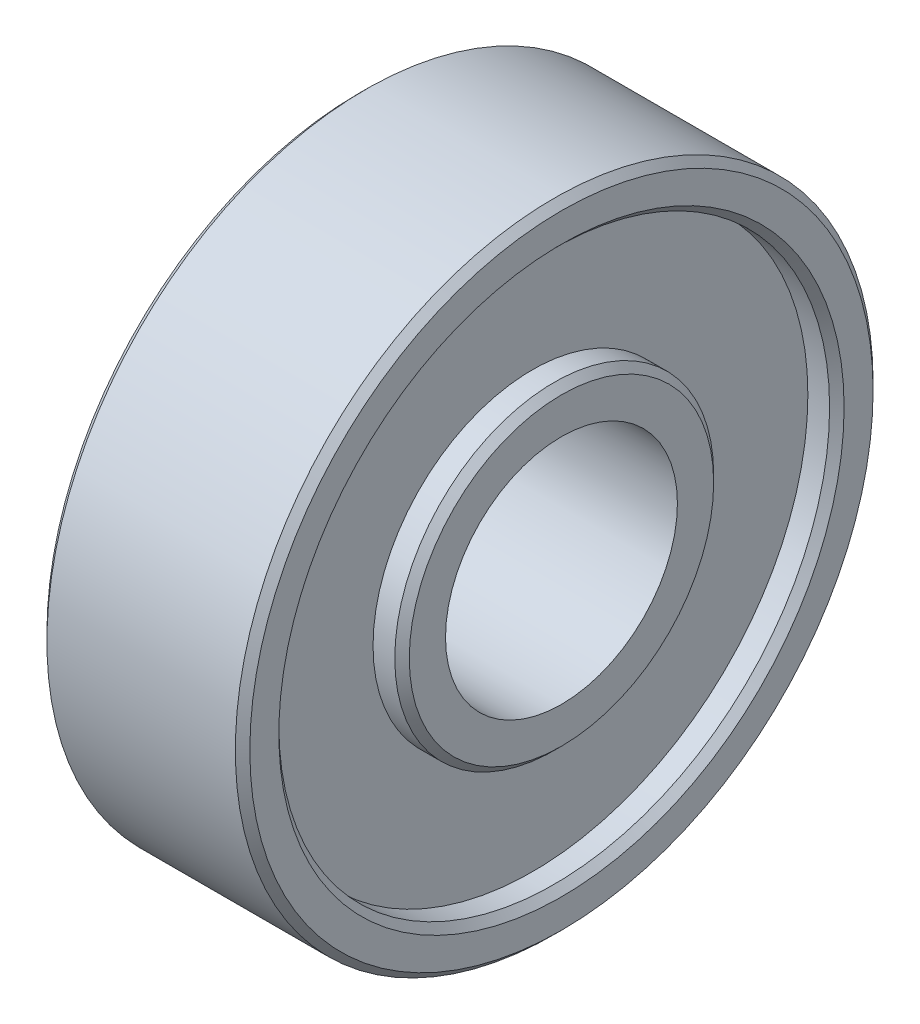
ISO-10303-21;
HEADER;
FILE_DESCRIPTION(('STEP AP214'),'2;1');
FILE_NAME('part.step','',(''),(''),'','','');
FILE_SCHEMA(('AUTOMOTIVE_DESIGN { 1 0 10303 214 1 1 1 1 }'));
ENDSEC;
DATA;
#1=APPLICATION_CONTEXT('core data for automotive mechanical design processes');
#2=APPLICATION_PROTOCOL_DEFINITION('international standard','automotive_design',2000,#1);
#3=PRODUCT_CONTEXT('',#1,'mechanical');
#4=PRODUCT('Part','Part','',(#3));
#5=PRODUCT_RELATED_PRODUCT_CATEGORY('part','',(#4));
#6=PRODUCT_DEFINITION_FORMATION('','',#4);
#7=PRODUCT_DEFINITION_CONTEXT('part definition',#1,'design');
#8=PRODUCT_DEFINITION('design','',#6,#7);
#9=PRODUCT_DEFINITION_SHAPE('','',#8);
#10=(LENGTH_UNIT() NAMED_UNIT(*) SI_UNIT(.MILLI.,.METRE.));
#11=(NAMED_UNIT(*) PLANE_ANGLE_UNIT() SI_UNIT($,.RADIAN.));
#12=(NAMED_UNIT(*) SI_UNIT($,.STERADIAN.) SOLID_ANGLE_UNIT());
#13=UNCERTAINTY_MEASURE_WITH_UNIT(LENGTH_MEASURE(1.E-05),#10,'distance_accuracy_value','');
#14=(GEOMETRIC_REPRESENTATION_CONTEXT(3) GLOBAL_UNCERTAINTY_ASSIGNED_CONTEXT((#13)) GLOBAL_UNIT_ASSIGNED_CONTEXT((#10,
#11,#12)) REPRESENTATION_CONTEXT('',''));
#15=CARTESIAN_POINT('',(0.,0.,0.));
#16=DIRECTION('',(0.,0.,1.));
#17=DIRECTION('',(1.,0.,0.));
#18=AXIS2_PLACEMENT_3D('',#15,#16,#17);
#19=CARTESIAN_POINT('',(7.,0.,0.));
#20=DIRECTION('',(1.,0.,0.));
#21=DIRECTION('',(0.,0.,-1.));
#22=AXIS2_PLACEMENT_3D('',#19,#20,#21);
#23=PLANE('',#22);
#24=CARTESIAN_POINT('',(7.,0.,0.));
#25=DIRECTION('',(1.,0.,0.));
#26=DIRECTION('',(0.,0.,-1.));
#27=AXIS2_PLACEMENT_3D('',#24,#25,#26);
#28=CIRCLE('',#27,5.24999999999999);
#29=CARTESIAN_POINT('',(7.,0.,-5.24999999999999));
#30=VERTEX_POINT('',#29);
#31=EDGE_CURVE('E45',#30,#30,#28,.T.);
#32=ORIENTED_EDGE('',*,*,#31,.T.);
#33=EDGE_LOOP('',(#32));
#34=FACE_BOUND('',#33,.T.);
#35=CARTESIAN_POINT('',(7.,0.,0.));
#36=DIRECTION('',(1.,0.,0.));
#37=DIRECTION('',(0.,0.,-1.));
#38=AXIS2_PLACEMENT_3D('',#35,#36,#37);
#39=CIRCLE('',#38,4.);
#40=CARTESIAN_POINT('',(7.,0.,-4.));
#41=VERTEX_POINT('',#40);
#42=EDGE_CURVE('E80',#41,#41,#39,.T.);
#43=ORIENTED_EDGE('',*,*,#42,.F.);
#44=EDGE_LOOP('',(#43));
#45=FACE_BOUND('',#44,.T.);
#46=ADVANCED_FACE('F30',(#34,#45),#23,.T.);
#47=CARTESIAN_POINT('',(0.,0.,0.));
#48=DIRECTION('',(1.,0.,0.));
#49=DIRECTION('',(0.,0.,-1.));
#50=AXIS2_PLACEMENT_3D('',#47,#48,#49);
#51=PLANE('',#50);
#52=CARTESIAN_POINT('',(0.,0.,0.));
#53=DIRECTION('',(1.,0.,0.));
#54=DIRECTION('',(0.,0.,-1.));
#55=AXIS2_PLACEMENT_3D('',#52,#53,#54);
#56=CIRCLE('',#55,5.25);
#57=CARTESIAN_POINT('',(0.,0.,-5.25));
#58=VERTEX_POINT('',#57);
#59=EDGE_CURVE('E59',#58,#58,#56,.F.);
#60=ORIENTED_EDGE('',*,*,#59,.T.);
#61=EDGE_LOOP('',(#60));
#62=FACE_BOUND('',#61,.T.);
#63=CARTESIAN_POINT('',(0.,0.,0.));
#64=DIRECTION('',(1.,0.,0.));
#65=DIRECTION('',(0.,0.,-1.));
#66=AXIS2_PLACEMENT_3D('',#63,#64,#65);
#67=CIRCLE('',#66,4.25);
#68=CARTESIAN_POINT('',(0.,0.,-4.25));
#69=VERTEX_POINT('',#68);
#70=EDGE_CURVE('E74',#69,#69,#67,.T.);
#71=ORIENTED_EDGE('',*,*,#70,.T.);
#72=EDGE_LOOP('',(#71));
#73=FACE_BOUND('',#72,.T.);
#74=ADVANCED_FACE('F115',(#62,#73),#51,.F.);
#75=CARTESIAN_POINT('',(7.,0.,0.));
#76=DIRECTION('',(1.,0.,0.));
#77=DIRECTION('',(0.,0.,-1.));
#78=AXIS2_PLACEMENT_3D('',#75,#76,#77);
#79=CIRCLE('',#78,9.74999999999999);
#80=CARTESIAN_POINT('',(7.,0.,-9.74999999999999));
#81=VERTEX_POINT('',#80);
#82=EDGE_CURVE('E10',#81,#81,#79,.F.);
#83=ORIENTED_EDGE('',*,*,#82,.T.);
#84=EDGE_LOOP('',(#83));
#85=FACE_BOUND('',#84,.T.);
#86=CARTESIAN_POINT('',(7.,0.,0.));
#87=DIRECTION('',(1.,0.,0.));
#88=DIRECTION('',(0.,0.,-1.));
#89=AXIS2_PLACEMENT_3D('',#86,#87,#88);
#90=CIRCLE('',#89,10.75);
#91=CARTESIAN_POINT('',(7.,0.,-10.75));
#92=VERTEX_POINT('',#91);
#93=EDGE_CURVE('E62',#92,#92,#90,.T.);
#94=ORIENTED_EDGE('',*,*,#93,.T.);
#95=EDGE_LOOP('',(#94));
#96=FACE_BOUND('',#95,.T.);
#97=ADVANCED_FACE('F118',(#85,#96),#23,.T.);
#98=CARTESIAN_POINT('',(0.,0.,0.));
#99=DIRECTION('',(1.,0.,0.));
#100=DIRECTION('',(0.,0.,-1.));
#101=AXIS2_PLACEMENT_3D('',#98,#99,#100);
#102=CIRCLE('',#101,9.75);
#103=CARTESIAN_POINT('',(0.,0.,-9.75));
#104=VERTEX_POINT('',#103);
#105=EDGE_CURVE('E50',#104,#104,#102,.T.);
#106=ORIENTED_EDGE('',*,*,#105,.T.);
#107=EDGE_LOOP('',(#106));
#108=FACE_BOUND('',#107,.T.);
#109=CARTESIAN_POINT('',(0.,0.,0.));
#110=DIRECTION('',(1.,0.,0.));
#111=DIRECTION('',(0.,0.,-1.));
#112=AXIS2_PLACEMENT_3D('',#109,#110,#111);
#113=CIRCLE('',#112,10.75);
#114=CARTESIAN_POINT('',(0.,0.,-10.75));
#115=VERTEX_POINT('',#114);
#116=EDGE_CURVE('E77',#115,#115,#113,.F.);
#117=ORIENTED_EDGE('',*,*,#116,.T.);
#118=EDGE_LOOP('',(#117));
#119=FACE_BOUND('',#118,.T.);
#120=ADVANCED_FACE('F124',(#108,#119),#51,.F.);
#121=CARTESIAN_POINT('',(7.,0.,0.));
#122=DIRECTION('',(-1.,0.,0.));
#123=DIRECTION('',(0.,0.,1.));
#124=AXIS2_PLACEMENT_3D('',#121,#122,#123);
#125=CYLINDRICAL_SURFACE('',#124,11.);
#126=CARTESIAN_POINT('',(0.249999999999999,0.,0.));
#127=DIRECTION('',(1.,0.,0.));
#128=DIRECTION('',(0.,0.,-1.));
#129=AXIS2_PLACEMENT_3D('',#126,#127,#128);
#130=CIRCLE('',#129,11.);
#131=CARTESIAN_POINT('',(0.249999999999999,0.,-11.));
#132=VERTEX_POINT('',#131);
#133=EDGE_CURVE('E65',#132,#132,#130,.T.);
#134=ORIENTED_EDGE('',*,*,#133,.T.);
#135=EDGE_LOOP('',(#134));
#136=FACE_BOUND('',#135,.T.);
#137=CARTESIAN_POINT('',(6.74999999999999,0.,0.));
#138=DIRECTION('',(1.,0.,0.));
#139=DIRECTION('',(0.,0.,-1.));
#140=AXIS2_PLACEMENT_3D('',#137,#138,#139);
#141=CIRCLE('',#140,11.);
#142=CARTESIAN_POINT('',(6.74999999999999,0.,-11.));
#143=VERTEX_POINT('',#142);
#144=EDGE_CURVE('E68',#143,#143,#141,.F.);
#145=ORIENTED_EDGE('',*,*,#144,.T.);
#146=EDGE_LOOP('',(#145));
#147=FACE_BOUND('',#146,.T.);
#148=ADVANCED_FACE('F131',(#136,#147),#125,.T.);
#149=CARTESIAN_POINT('',(7.,0.,0.));
#150=DIRECTION('',(-1.,0.,0.));
#151=DIRECTION('',(0.,0.,1.));
#152=AXIS2_PLACEMENT_3D('',#149,#150,#151);
#153=CYLINDRICAL_SURFACE('',#152,4.);
#154=CARTESIAN_POINT('',(0.250000000000001,0.,0.));
#155=DIRECTION('',(1.,0.,0.));
#156=DIRECTION('',(0.,0.,-1.));
#157=AXIS2_PLACEMENT_3D('',#154,#155,#156);
#158=CIRCLE('',#157,4.);
#159=CARTESIAN_POINT('',(0.250000000000001,0.,-4.));
#160=VERTEX_POINT('',#159);
#161=EDGE_CURVE('E71',#160,#160,#158,.F.);
#162=ORIENTED_EDGE('',*,*,#161,.T.);
#163=EDGE_LOOP('',(#162));
#164=FACE_BOUND('',#163,.T.);
#165=ORIENTED_EDGE('',*,*,#42,.T.);
#166=EDGE_LOOP('',(#165));
#167=FACE_BOUND('',#166,.T.);
#168=ADVANCED_FACE('F255',(#164,#167),#153,.F.);
#169=CARTESIAN_POINT('',(0.,0.,0.));
#170=DIRECTION('',(-1.,0.,0.));
#171=DIRECTION('',(0.,0.,1.));
#172=AXIS2_PLACEMENT_3D('',#169,#170,#171);
#173=CONICAL_SURFACE('',#172,4.25,0.785398163397447);
#174=ORIENTED_EDGE('',*,*,#161,.F.);
#175=EDGE_LOOP('',(#174));
#176=FACE_BOUND('',#175,.T.);
#177=ORIENTED_EDGE('',*,*,#70,.F.);
#178=EDGE_LOOP('',(#177));
#179=FACE_BOUND('',#178,.T.);
#180=ADVANCED_FACE('F148',(#176,#179),#173,.F.);
#181=CARTESIAN_POINT('',(0.249999999999999,0.,0.));
#182=DIRECTION('',(1.,0.,0.));
#183=DIRECTION('',(0.,0.,-1.));
#184=AXIS2_PLACEMENT_3D('',#181,#182,#183);
#185=CONICAL_SURFACE('',#184,11.,0.785398163397448);
#186=ORIENTED_EDGE('',*,*,#116,.F.);
#187=EDGE_LOOP('',(#186));
#188=FACE_BOUND('',#187,.T.);
#189=ORIENTED_EDGE('',*,*,#133,.F.);
#190=EDGE_LOOP('',(#189));
#191=FACE_BOUND('',#190,.T.);
#192=ADVANCED_FACE('F139',(#188,#191),#185,.T.);
#193=CARTESIAN_POINT('',(7.,0.,0.));
#194=DIRECTION('',(-1.,0.,0.));
#195=DIRECTION('',(0.,0.,1.));
#196=AXIS2_PLACEMENT_3D('',#193,#194,#195);
#197=CONICAL_SURFACE('',#196,10.75,0.785398163397438);
#198=ORIENTED_EDGE('',*,*,#144,.F.);
#199=EDGE_LOOP('',(#198));
#200=FACE_BOUND('',#199,.T.);
#201=ORIENTED_EDGE('',*,*,#93,.F.);
#202=EDGE_LOOP('',(#201));
#203=FACE_BOUND('',#202,.T.);
#204=ADVANCED_FACE('F136',(#200,#203),#197,.T.);
#205=CARTESIAN_POINT('',(1.,0.,0.));
#206=DIRECTION('',(-1.,0.,0.));
#207=DIRECTION('',(0.,0.,1.));
#208=AXIS2_PLACEMENT_3D('',#205,#206,#207);
#209=CYLINDRICAL_SURFACE('',#208,9.5);
#210=CARTESIAN_POINT('',(0.249999999999995,0.,0.));
#211=DIRECTION('',(1.,0.,0.));
#212=DIRECTION('',(0.,0.,-1.));
#213=AXIS2_PLACEMENT_3D('',#210,#211,#212);
#214=CIRCLE('',#213,9.5);
#215=CARTESIAN_POINT('',(0.249999999999995,0.,-9.5));
#216=VERTEX_POINT('',#215);
#217=EDGE_CURVE('E53',#216,#216,#214,.F.);
#218=ORIENTED_EDGE('',*,*,#217,.T.);
#219=EDGE_LOOP('',(#218));
#220=FACE_BOUND('',#219,.T.);
#221=CARTESIAN_POINT('',(1.,0.,0.));
#222=DIRECTION('',(-1.,0.,0.));
#223=DIRECTION('',(0.,0.,1.));
#224=AXIS2_PLACEMENT_3D('',#221,#222,#223);
#225=CIRCLE('',#224,9.5);
#226=CARTESIAN_POINT('',(1.,0.,9.5));
#227=VERTEX_POINT('',#226);
#228=EDGE_CURVE('E83',#227,#227,#225,.T.);
#229=ORIENTED_EDGE('',*,*,#228,.F.);
#230=EDGE_LOOP('',(#229));
#231=FACE_BOUND('',#230,.T.);
#232=ADVANCED_FACE('F138',(#220,#231),#209,.F.);
#233=CARTESIAN_POINT('',(1.,0.,0.));
#234=DIRECTION('',(-1.,0.,0.));
#235=DIRECTION('',(0.,0.,1.));
#236=AXIS2_PLACEMENT_3D('',#233,#234,#235);
#237=PLANE('',#236);
#238=CARTESIAN_POINT('',(1.,0.,0.));
#239=DIRECTION('',(-1.,0.,0.));
#240=DIRECTION('',(0.,0.,1.));
#241=AXIS2_PLACEMENT_3D('',#238,#239,#240);
#242=CIRCLE('',#241,5.5);
#243=CARTESIAN_POINT('',(1.,0.,5.5));
#244=VERTEX_POINT('',#243);
#245=EDGE_CURVE('E86',#244,#244,#242,.T.);
#246=ORIENTED_EDGE('',*,*,#245,.F.);
#247=EDGE_LOOP('',(#246));
#248=FACE_BOUND('',#247,.T.);
#249=ORIENTED_EDGE('',*,*,#228,.T.);
#250=EDGE_LOOP('',(#249));
#251=FACE_BOUND('',#250,.T.);
#252=ADVANCED_FACE('F111',(#248,#251),#237,.T.);
#253=CARTESIAN_POINT('',(1.,0.,0.));
#254=DIRECTION('',(-1.,0.,0.));
#255=DIRECTION('',(0.,0.,1.));
#256=AXIS2_PLACEMENT_3D('',#253,#254,#255);
#257=CYLINDRICAL_SURFACE('',#256,5.5);
#258=CARTESIAN_POINT('',(0.250000000000003,0.,0.));
#259=DIRECTION('',(1.,0.,0.));
#260=DIRECTION('',(0.,0.,-1.));
#261=AXIS2_PLACEMENT_3D('',#258,#259,#260);
#262=CIRCLE('',#261,5.5);
#263=CARTESIAN_POINT('',(0.250000000000003,0.,-5.5));
#264=VERTEX_POINT('',#263);
#265=EDGE_CURVE('E56',#264,#264,#262,.T.);
#266=ORIENTED_EDGE('',*,*,#265,.T.);
#267=EDGE_LOOP('',(#266));
#268=FACE_BOUND('',#267,.T.);
#269=ORIENTED_EDGE('',*,*,#245,.T.);
#270=EDGE_LOOP('',(#269));
#271=FACE_BOUND('',#270,.T.);
#272=ADVANCED_FACE('F106',(#268,#271),#257,.T.);
#273=CARTESIAN_POINT('',(6.,0.,0.));
#274=DIRECTION('',(1.,0.,0.));
#275=DIRECTION('',(0.,0.,-1.));
#276=AXIS2_PLACEMENT_3D('',#273,#274,#275);
#277=CYLINDRICAL_SURFACE('',#276,9.5);
#278=CARTESIAN_POINT('',(6.75000000000001,0.,0.));
#279=DIRECTION('',(1.,0.,0.));
#280=DIRECTION('',(0.,0.,-1.));
#281=AXIS2_PLACEMENT_3D('',#278,#279,#280);
#282=CIRCLE('',#281,9.5);
#283=CARTESIAN_POINT('',(6.75000000000001,0.,-9.5));
#284=VERTEX_POINT('',#283);
#285=EDGE_CURVE('E37',#284,#284,#282,.T.);
#286=ORIENTED_EDGE('',*,*,#285,.T.);
#287=EDGE_LOOP('',(#286));
#288=FACE_BOUND('',#287,.T.);
#289=CARTESIAN_POINT('',(6.,0.,0.));
#290=DIRECTION('',(1.,0.,0.));
#291=DIRECTION('',(0.,0.,-1.));
#292=AXIS2_PLACEMENT_3D('',#289,#290,#291);
#293=CIRCLE('',#292,9.5);
#294=CARTESIAN_POINT('',(6.,0.,-9.5));
#295=VERTEX_POINT('',#294);
#296=EDGE_CURVE('E89',#295,#295,#293,.T.);
#297=ORIENTED_EDGE('',*,*,#296,.F.);
#298=EDGE_LOOP('',(#297));
#299=FACE_BOUND('',#298,.T.);
#300=ADVANCED_FACE('F101',(#288,#299),#277,.F.);
#301=CARTESIAN_POINT('',(6.,0.,0.));
#302=DIRECTION('',(1.,0.,0.));
#303=DIRECTION('',(0.,0.,-1.));
#304=AXIS2_PLACEMENT_3D('',#301,#302,#303);
#305=PLANE('',#304);
#306=CARTESIAN_POINT('',(6.,0.,0.));
#307=DIRECTION('',(1.,0.,0.));
#308=DIRECTION('',(0.,0.,-1.));
#309=AXIS2_PLACEMENT_3D('',#306,#307,#308);
#310=CIRCLE('',#309,5.5);
#311=CARTESIAN_POINT('',(6.,0.,-5.5));
#312=VERTEX_POINT('',#311);
#313=EDGE_CURVE('E92',#312,#312,#310,.T.);
#314=ORIENTED_EDGE('',*,*,#313,.F.);
#315=EDGE_LOOP('',(#314));
#316=FACE_BOUND('',#315,.T.);
#317=ORIENTED_EDGE('',*,*,#296,.T.);
#318=EDGE_LOOP('',(#317));
#319=FACE_BOUND('',#318,.T.);
#320=ADVANCED_FACE('F98',(#316,#319),#305,.T.);
#321=CARTESIAN_POINT('',(6.,0.,0.));
#322=DIRECTION('',(1.,0.,0.));
#323=DIRECTION('',(0.,0.,-1.));
#324=AXIS2_PLACEMENT_3D('',#321,#322,#323);
#325=CYLINDRICAL_SURFACE('',#324,5.5);
#326=CARTESIAN_POINT('',(6.74999999999999,0.,0.));
#327=DIRECTION('',(1.,0.,0.));
#328=DIRECTION('',(0.,0.,-1.));
#329=AXIS2_PLACEMENT_3D('',#326,#327,#328);
#330=CIRCLE('',#329,5.5);
#331=CARTESIAN_POINT('',(6.74999999999999,0.,-5.5));
#332=VERTEX_POINT('',#331);
#333=EDGE_CURVE('E41',#332,#332,#330,.F.);
#334=ORIENTED_EDGE('',*,*,#333,.T.);
#335=EDGE_LOOP('',(#334));
#336=FACE_BOUND('',#335,.T.);
#337=ORIENTED_EDGE('',*,*,#313,.T.);
#338=EDGE_LOOP('',(#337));
#339=FACE_BOUND('',#338,.T.);
#340=ADVANCED_FACE('F96',(#336,#339),#325,.T.);
#341=CARTESIAN_POINT('',(0.,0.,0.));
#342=DIRECTION('',(1.,0.,0.));
#343=DIRECTION('',(0.,0.,-1.));
#344=AXIS2_PLACEMENT_3D('',#341,#342,#343);
#345=CONICAL_SURFACE('',#344,5.25,0.785398163397447);
#346=ORIENTED_EDGE('',*,*,#265,.F.);
#347=EDGE_LOOP('',(#346));
#348=FACE_BOUND('',#347,.T.);
#349=ORIENTED_EDGE('',*,*,#59,.F.);
#350=EDGE_LOOP('',(#349));
#351=FACE_BOUND('',#350,.T.);
#352=ADVANCED_FACE('F154',(#348,#351),#345,.T.);
#353=CARTESIAN_POINT('',(0.249999999999995,0.,0.));
#354=DIRECTION('',(-1.,0.,0.));
#355=DIRECTION('',(0.,0.,1.));
#356=AXIS2_PLACEMENT_3D('',#353,#354,#355);
#357=CONICAL_SURFACE('',#356,9.5,0.785398163397455);
#358=ORIENTED_EDGE('',*,*,#105,.F.);
#359=EDGE_LOOP('',(#358));
#360=FACE_BOUND('',#359,.T.);
#361=ORIENTED_EDGE('',*,*,#217,.F.);
#362=EDGE_LOOP('',(#361));
#363=FACE_BOUND('',#362,.T.);
#364=ADVANCED_FACE('F157',(#360,#363),#357,.F.);
#365=CARTESIAN_POINT('',(7.,0.,0.));
#366=DIRECTION('',(-1.,0.,0.));
#367=DIRECTION('',(0.,0.,1.));
#368=AXIS2_PLACEMENT_3D('',#365,#366,#367);
#369=CONICAL_SURFACE('',#368,5.24999999999999,0.785398163397447);
#370=ORIENTED_EDGE('',*,*,#333,.F.);
#371=EDGE_LOOP('',(#370));
#372=FACE_BOUND('',#371,.T.);
#373=ORIENTED_EDGE('',*,*,#31,.F.);
#374=EDGE_LOOP('',(#373));
#375=FACE_BOUND('',#374,.T.);
#376=ADVANCED_FACE('F160',(#372,#375),#369,.T.);
#377=CARTESIAN_POINT('',(6.75000000000001,0.,0.));
#378=DIRECTION('',(1.,0.,0.));
#379=DIRECTION('',(0.,0.,-1.));
#380=AXIS2_PLACEMENT_3D('',#377,#378,#379);
#381=CONICAL_SURFACE('',#380,9.5,0.785398163397441);
#382=ORIENTED_EDGE('',*,*,#82,.F.);
#383=EDGE_LOOP('',(#382));
#384=FACE_BOUND('',#383,.T.);
#385=ORIENTED_EDGE('',*,*,#285,.F.);
#386=EDGE_LOOP('',(#385));
#387=FACE_BOUND('',#386,.T.);
#388=ADVANCED_FACE('F32',(#384,#387),#381,.F.);
#389=CLOSED_SHELL('',(#46,#74,#97,#120,#148,#168,#180,#192,#204,#232,#252,#272,#300,#320,#340,
#352,#364,#376,#388));
#390=MANIFOLD_SOLID_BREP('B2',#389);
#391=ADVANCED_BREP_SHAPE_REPRESENTATION('',(#18,#390),#14);
#392=SHAPE_DEFINITION_REPRESENTATION(#9,#391);
ENDSEC;
END-ISO-10303-21;
